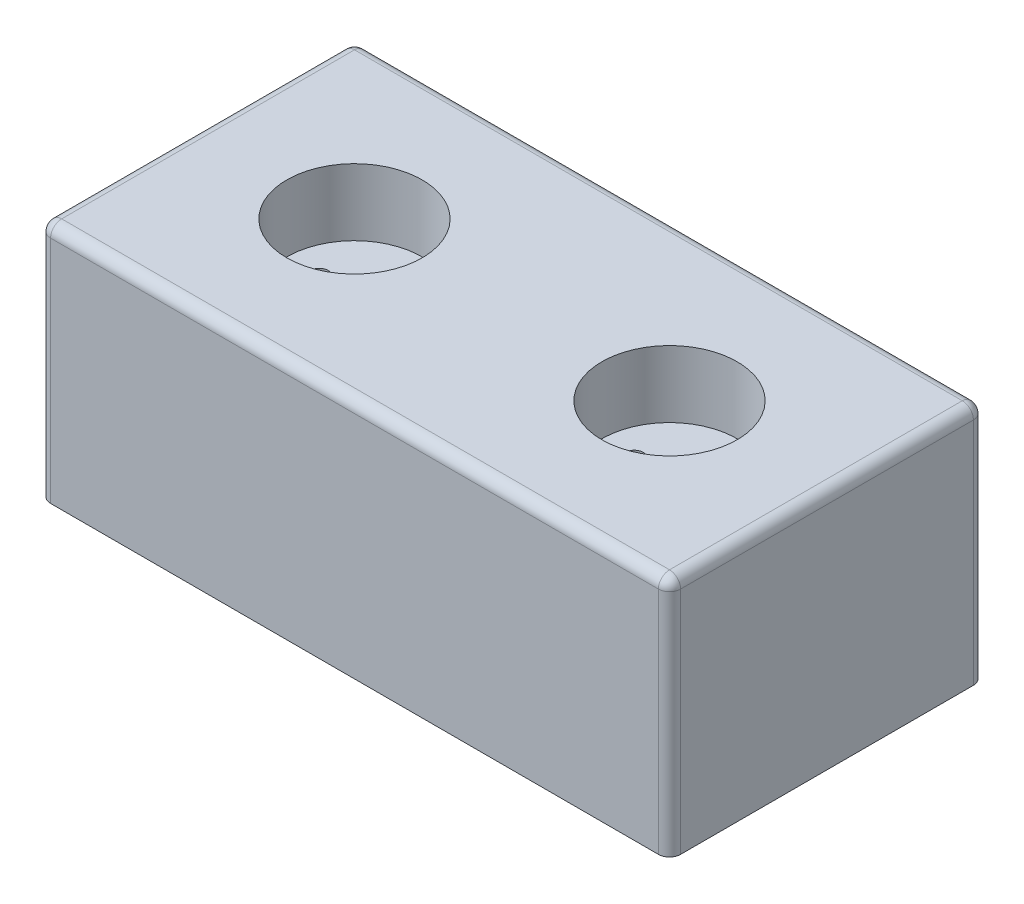
ISO-10303-21;
HEADER;
FILE_DESCRIPTION(('STEP AP214'),'2;1');
FILE_NAME('part.step','',(''),(''),'','','');
FILE_SCHEMA(('AUTOMOTIVE_DESIGN { 1 0 10303 214 1 1 1 1 }'));
ENDSEC;
DATA;
#1=APPLICATION_CONTEXT('core data for automotive mechanical design processes');
#2=APPLICATION_PROTOCOL_DEFINITION('international standard','automotive_design',2000,#1);
#3=PRODUCT_CONTEXT('',#1,'mechanical');
#4=PRODUCT('Part','Part','',(#3));
#5=PRODUCT_RELATED_PRODUCT_CATEGORY('part','',(#4));
#6=PRODUCT_DEFINITION_FORMATION('','',#4);
#7=PRODUCT_DEFINITION_CONTEXT('part definition',#1,'design');
#8=PRODUCT_DEFINITION('design','',#6,#7);
#9=PRODUCT_DEFINITION_SHAPE('','',#8);
#10=(LENGTH_UNIT() NAMED_UNIT(*) SI_UNIT(.MILLI.,.METRE.));
#11=(NAMED_UNIT(*) PLANE_ANGLE_UNIT() SI_UNIT($,.RADIAN.));
#12=(NAMED_UNIT(*) SI_UNIT($,.STERADIAN.) SOLID_ANGLE_UNIT());
#13=UNCERTAINTY_MEASURE_WITH_UNIT(LENGTH_MEASURE(1.E-05),#10,'distance_accuracy_value','');
#14=(GEOMETRIC_REPRESENTATION_CONTEXT(3) GLOBAL_UNCERTAINTY_ASSIGNED_CONTEXT((#13)) GLOBAL_UNIT_ASSIGNED_CONTEXT((#10,
#11,#12)) REPRESENTATION_CONTEXT('',''));
#15=CARTESIAN_POINT('',(0.,0.,0.));
#16=DIRECTION('',(0.,0.,1.));
#17=DIRECTION('',(1.,0.,0.));
#18=AXIS2_PLACEMENT_3D('',#15,#16,#17);
#19=CARTESIAN_POINT('',(-85.,65.,42.5));
#20=DIRECTION('',(1.,0.,0.));
#21=DIRECTION('',(0.,0.,-1.));
#22=AXIS2_PLACEMENT_3D('',#19,#20,#21);
#23=PLANE('',#22);
#24=DIRECTION('',(0.,0.,1.));
#25=VECTOR('',#24,1.);
#26=CARTESIAN_POINT('',(-85.,62.,-42.5));
#27=LINE('',#26,#25);
#28=CARTESIAN_POINT('',(-85.,62.,39.5));
#29=VERTEX_POINT('',#28);
#30=CARTESIAN_POINT('',(-85.,62.,-39.5));
#31=VERTEX_POINT('',#30);
#32=EDGE_CURVE('E157',#29,#31,#27,.F.);
#33=ORIENTED_EDGE('',*,*,#32,.T.);
#34=DIRECTION('',(0.,-1.,0.));
#35=VECTOR('',#34,1.);
#36=CARTESIAN_POINT('',(-85.,65.,-39.5));
#37=LINE('',#36,#35);
#38=CARTESIAN_POINT('',(-85.,0.,-39.5));
#39=VERTEX_POINT('',#38);
#40=EDGE_CURVE('E161',#31,#39,#37,.T.);
#41=ORIENTED_EDGE('',*,*,#40,.T.);
#42=DIRECTION('',(0.,0.,1.));
#43=VECTOR('',#42,1.);
#44=CARTESIAN_POINT('',(-85.,0.,42.5));
#45=LINE('',#44,#43);
#46=CARTESIAN_POINT('',(-85.,0.,39.5));
#47=VERTEX_POINT('',#46);
#48=EDGE_CURVE('E223',#39,#47,#45,.T.);
#49=ORIENTED_EDGE('',*,*,#48,.T.);
#50=DIRECTION('',(0.,-1.,0.));
#51=VECTOR('',#50,1.);
#52=CARTESIAN_POINT('',(-85.,65.,39.5));
#53=LINE('',#52,#51);
#54=EDGE_CURVE('E159',#47,#29,#53,.F.);
#55=ORIENTED_EDGE('',*,*,#54,.T.);
#56=EDGE_LOOP('',(#33,#41,#49,#55));
#57=FACE_BOUND('',#56,.T.);
#58=ADVANCED_FACE('F35',(#57),#23,.F.);
#59=CARTESIAN_POINT('',(85.,65.,42.5));
#60=DIRECTION('',(0.,0.,-1.));
#61=DIRECTION('',(-1.,0.,0.));
#62=AXIS2_PLACEMENT_3D('',#59,#60,#61);
#63=PLANE('',#62);
#64=DIRECTION('',(1.,0.,0.));
#65=VECTOR('',#64,1.);
#66=CARTESIAN_POINT('',(85.,0.,42.5));
#67=LINE('',#66,#65);
#68=CARTESIAN_POINT('',(-82.,0.,42.5));
#69=VERTEX_POINT('',#68);
#70=CARTESIAN_POINT('',(82.,0.,42.5));
#71=VERTEX_POINT('',#70);
#72=EDGE_CURVE('E144',#69,#71,#67,.T.);
#73=ORIENTED_EDGE('',*,*,#72,.T.);
#74=DIRECTION('',(0.,-1.,0.));
#75=VECTOR('',#74,1.);
#76=CARTESIAN_POINT('',(82.,65.,42.5));
#77=LINE('',#76,#75);
#78=CARTESIAN_POINT('',(82.,62.,42.5));
#79=VERTEX_POINT('',#78);
#80=EDGE_CURVE('E167',#71,#79,#77,.F.);
#81=ORIENTED_EDGE('',*,*,#80,.T.);
#82=DIRECTION('',(1.,0.,0.));
#83=VECTOR('',#82,1.);
#84=CARTESIAN_POINT('',(-85.,62.,42.5));
#85=LINE('',#84,#83);
#86=CARTESIAN_POINT('',(-82.,62.,42.5));
#87=VERTEX_POINT('',#86);
#88=EDGE_CURVE('E163',#79,#87,#85,.F.);
#89=ORIENTED_EDGE('',*,*,#88,.T.);
#90=DIRECTION('',(0.,-1.,0.));
#91=VECTOR('',#90,1.);
#92=CARTESIAN_POINT('',(-82.,65.,42.5));
#93=LINE('',#92,#91);
#94=EDGE_CURVE('E165',#87,#69,#93,.T.);
#95=ORIENTED_EDGE('',*,*,#94,.T.);
#96=EDGE_LOOP('',(#73,#81,#89,#95));
#97=FACE_BOUND('',#96,.T.);
#98=ADVANCED_FACE('F239',(#97),#63,.F.);
#99=CARTESIAN_POINT('',(85.,65.,42.5));
#100=DIRECTION('',(-1.,0.,0.));
#101=DIRECTION('',(0.,0.,1.));
#102=AXIS2_PLACEMENT_3D('',#99,#100,#101);
#103=PLANE('',#102);
#104=DIRECTION('',(0.,0.,-1.));
#105=VECTOR('',#104,1.);
#106=CARTESIAN_POINT('',(85.,0.,42.5));
#107=LINE('',#106,#105);
#108=CARTESIAN_POINT('',(85.,0.,39.5));
#109=VERTEX_POINT('',#108);
#110=CARTESIAN_POINT('',(85.,0.,-39.5));
#111=VERTEX_POINT('',#110);
#112=EDGE_CURVE('E141',#109,#111,#107,.T.);
#113=ORIENTED_EDGE('',*,*,#112,.T.);
#114=DIRECTION('',(0.,-1.,0.));
#115=VECTOR('',#114,1.);
#116=CARTESIAN_POINT('',(85.,65.,-39.5));
#117=LINE('',#116,#115);
#118=CARTESIAN_POINT('',(85.,62.,-39.5));
#119=VERTEX_POINT('',#118);
#120=EDGE_CURVE('E120',#111,#119,#117,.F.);
#121=ORIENTED_EDGE('',*,*,#120,.T.);
#122=DIRECTION('',(0.,0.,-1.));
#123=VECTOR('',#122,1.);
#124=CARTESIAN_POINT('',(85.,62.,42.5));
#125=LINE('',#124,#123);
#126=CARTESIAN_POINT('',(85.,62.,39.5));
#127=VERTEX_POINT('',#126);
#128=EDGE_CURVE('E125',#119,#127,#125,.F.);
#129=ORIENTED_EDGE('',*,*,#128,.T.);
#130=DIRECTION('',(0.,-1.,0.));
#131=VECTOR('',#130,1.);
#132=CARTESIAN_POINT('',(85.,65.,39.5));
#133=LINE('',#132,#131);
#134=EDGE_CURVE('E154',#127,#109,#133,.T.);
#135=ORIENTED_EDGE('',*,*,#134,.T.);
#136=EDGE_LOOP('',(#113,#121,#129,#135));
#137=FACE_BOUND('',#136,.T.);
#138=ADVANCED_FACE('F274',(#137),#103,.F.);
#139=CARTESIAN_POINT('',(85.,65.,-42.5));
#140=DIRECTION('',(0.,0.,1.));
#141=DIRECTION('',(1.,0.,0.));
#142=AXIS2_PLACEMENT_3D('',#139,#140,#141);
#143=PLANE('',#142);
#144=DIRECTION('',(-1.,0.,0.));
#145=VECTOR('',#144,1.);
#146=CARTESIAN_POINT('',(85.,62.,-42.5));
#147=LINE('',#146,#145);
#148=CARTESIAN_POINT('',(-82.,62.,-42.5));
#149=VERTEX_POINT('',#148);
#150=CARTESIAN_POINT('',(82.,62.,-42.5));
#151=VERTEX_POINT('',#150);
#152=EDGE_CURVE('E134',#149,#151,#147,.F.);
#153=ORIENTED_EDGE('',*,*,#152,.T.);
#154=DIRECTION('',(0.,-1.,0.));
#155=VECTOR('',#154,1.);
#156=CARTESIAN_POINT('',(82.,65.,-42.5));
#157=LINE('',#156,#155);
#158=CARTESIAN_POINT('',(82.,0.,-42.5));
#159=VERTEX_POINT('',#158);
#160=EDGE_CURVE('E119',#151,#159,#157,.T.);
#161=ORIENTED_EDGE('',*,*,#160,.T.);
#162=DIRECTION('',(-1.,0.,0.));
#163=VECTOR('',#162,1.);
#164=CARTESIAN_POINT('',(85.,0.,-42.5));
#165=LINE('',#164,#163);
#166=CARTESIAN_POINT('',(-82.,0.,-42.5));
#167=VERTEX_POINT('',#166);
#168=EDGE_CURVE('E131',#159,#167,#165,.T.);
#169=ORIENTED_EDGE('',*,*,#168,.T.);
#170=DIRECTION('',(0.,-1.,0.));
#171=VECTOR('',#170,1.);
#172=CARTESIAN_POINT('',(-82.,65.,-42.5));
#173=LINE('',#172,#171);
#174=EDGE_CURVE('E136',#167,#149,#173,.F.);
#175=ORIENTED_EDGE('',*,*,#174,.T.);
#176=EDGE_LOOP('',(#153,#161,#169,#175));
#177=FACE_BOUND('',#176,.T.);
#178=ADVANCED_FACE('F130',(#177),#143,.F.);
#179=CARTESIAN_POINT('',(0.,65.,0.));
#180=DIRECTION('',(0.,1.,0.));
#181=DIRECTION('',(0.,0.,1.));
#182=AXIS2_PLACEMENT_3D('',#179,#180,#181);
#183=PLANE('',#182);
#184=DIRECTION('',(1.,0.,0.));
#185=VECTOR('',#184,1.);
#186=CARTESIAN_POINT('',(85.,65.,39.5));
#187=LINE('',#186,#185);
#188=CARTESIAN_POINT('',(-82.,65.,39.5));
#189=VERTEX_POINT('',#188);
#190=CARTESIAN_POINT('',(82.,65.,39.5));
#191=VERTEX_POINT('',#190);
#192=EDGE_CURVE('E169',#189,#191,#187,.T.);
#193=ORIENTED_EDGE('',*,*,#192,.T.);
#194=DIRECTION('',(0.,0.,-1.));
#195=VECTOR('',#194,1.);
#196=CARTESIAN_POINT('',(82.,65.,-42.5));
#197=LINE('',#196,#195);
#198=CARTESIAN_POINT('',(82.,65.,-39.5));
#199=VERTEX_POINT('',#198);
#200=EDGE_CURVE('E11',#191,#199,#197,.T.);
#201=ORIENTED_EDGE('',*,*,#200,.T.);
#202=DIRECTION('',(-1.,0.,0.));
#203=VECTOR('',#202,1.);
#204=CARTESIAN_POINT('',(-85.,65.,-39.5));
#205=LINE('',#204,#203);
#206=CARTESIAN_POINT('',(-82.,65.,-39.5));
#207=VERTEX_POINT('',#206);
#208=EDGE_CURVE('E44',#199,#207,#205,.T.);
#209=ORIENTED_EDGE('',*,*,#208,.T.);
#210=DIRECTION('',(0.,0.,1.));
#211=VECTOR('',#210,1.);
#212=CARTESIAN_POINT('',(-82.,65.,42.5));
#213=LINE('',#212,#211);
#214=EDGE_CURVE('E171',#207,#189,#213,.T.);
#215=ORIENTED_EDGE('',*,*,#214,.T.);
#216=EDGE_LOOP('',(#193,#201,#209,#215));
#217=FACE_BOUND('',#216,.T.);
#218=CARTESIAN_POINT('',(-42.5,65.,0.));
#219=DIRECTION('',(0.,1.,0.));
#220=DIRECTION('',(0.,0.,1.));
#221=AXIS2_PLACEMENT_3D('',#218,#219,#220);
#222=CIRCLE('',#221,18.25);
#223=CARTESIAN_POINT('',(-42.5,65.,18.25));
#224=VERTEX_POINT('',#223);
#225=EDGE_CURVE('E224',#224,#224,#222,.T.);
#226=ORIENTED_EDGE('',*,*,#225,.F.);
#227=EDGE_LOOP('',(#226));
#228=FACE_BOUND('',#227,.T.);
#229=CARTESIAN_POINT('',(42.5,65.,0.));
#230=DIRECTION('',(0.,1.,0.));
#231=DIRECTION('',(0.,0.,1.));
#232=AXIS2_PLACEMENT_3D('',#229,#230,#231);
#233=CIRCLE('',#232,18.25);
#234=CARTESIAN_POINT('',(42.5,65.,18.25));
#235=VERTEX_POINT('',#234);
#236=EDGE_CURVE('E230',#235,#235,#233,.T.);
#237=ORIENTED_EDGE('',*,*,#236,.F.);
#238=EDGE_LOOP('',(#237));
#239=FACE_BOUND('',#238,.T.);
#240=ADVANCED_FACE('F281',(#217,#228,#239),#183,.T.);
#241=CARTESIAN_POINT('',(0.,0.,0.));
#242=DIRECTION('',(0.,1.,0.));
#243=DIRECTION('',(0.,0.,1.));
#244=AXIS2_PLACEMENT_3D('',#241,#242,#243);
#245=PLANE('',#244);
#246=ORIENTED_EDGE('',*,*,#168,.F.);
#247=CARTESIAN_POINT('',(82.,0.,-39.5));
#248=DIRECTION('',(0.,1.,0.));
#249=DIRECTION('',(0.,0.,1.));
#250=AXIS2_PLACEMENT_3D('',#247,#248,#249);
#251=CIRCLE('',#250,3.);
#252=EDGE_CURVE('E115',#159,#111,#251,.F.);
#253=ORIENTED_EDGE('',*,*,#252,.T.);
#254=ORIENTED_EDGE('',*,*,#112,.F.);
#255=CARTESIAN_POINT('',(82.,0.,39.5));
#256=DIRECTION('',(0.,1.,0.));
#257=DIRECTION('',(0.,0.,1.));
#258=AXIS2_PLACEMENT_3D('',#255,#256,#257);
#259=CIRCLE('',#258,3.);
#260=EDGE_CURVE('E150',#109,#71,#259,.F.);
#261=ORIENTED_EDGE('',*,*,#260,.T.);
#262=ORIENTED_EDGE('',*,*,#72,.F.);
#263=CARTESIAN_POINT('',(-82.,0.,39.5));
#264=DIRECTION('',(0.,1.,0.));
#265=DIRECTION('',(0.,0.,1.));
#266=AXIS2_PLACEMENT_3D('',#263,#264,#265);
#267=CIRCLE('',#266,3.);
#268=EDGE_CURVE('E135',#69,#47,#267,.F.);
#269=ORIENTED_EDGE('',*,*,#268,.T.);
#270=ORIENTED_EDGE('',*,*,#48,.F.);
#271=CARTESIAN_POINT('',(-82.,0.,-39.5));
#272=DIRECTION('',(0.,1.,0.));
#273=DIRECTION('',(0.,0.,1.));
#274=AXIS2_PLACEMENT_3D('',#271,#272,#273);
#275=CIRCLE('',#274,3.);
#276=EDGE_CURVE('E126',#39,#167,#275,.F.);
#277=ORIENTED_EDGE('',*,*,#276,.T.);
#278=EDGE_LOOP('',(#246,#253,#254,#261,#262,#269,#270,#277));
#279=FACE_BOUND('',#278,.T.);
#280=ADVANCED_FACE('F138',(#279),#245,.F.);
#281=CARTESIAN_POINT('',(42.5,47.,0.));
#282=DIRECTION('',(0.,1.,0.));
#283=DIRECTION('',(0.,0.,1.));
#284=AXIS2_PLACEMENT_3D('',#281,#282,#283);
#285=CYLINDRICAL_SURFACE('',#284,18.25);
#286=CARTESIAN_POINT('',(42.5,47.,0.));
#287=DIRECTION('',(0.,1.,0.));
#288=DIRECTION('',(0.,0.,1.));
#289=AXIS2_PLACEMENT_3D('',#286,#287,#288);
#290=CIRCLE('',#289,18.25);
#291=CARTESIAN_POINT('',(42.5,47.,18.25));
#292=VERTEX_POINT('',#291);
#293=EDGE_CURVE('E227',#292,#292,#290,.T.);
#294=ORIENTED_EDGE('',*,*,#293,.F.);
#295=EDGE_LOOP('',(#294));
#296=FACE_BOUND('',#295,.T.);
#297=ORIENTED_EDGE('',*,*,#236,.T.);
#298=EDGE_LOOP('',(#297));
#299=FACE_BOUND('',#298,.T.);
#300=ADVANCED_FACE('F350',(#296,#299),#285,.F.);
#301=CARTESIAN_POINT('',(42.5,47.,0.));
#302=DIRECTION('',(0.,1.,0.));
#303=DIRECTION('',(0.,0.,1.));
#304=AXIS2_PLACEMENT_3D('',#301,#302,#303);
#305=PLANE('',#304);
#306=CARTESIAN_POINT('',(33.,47.,0.));
#307=DIRECTION('',(0.,1.,0.));
#308=DIRECTION('',(0.,0.,1.));
#309=AXIS2_PLACEMENT_3D('',#306,#307,#308);
#310=CIRCLE('',#309,2.4);
#311=CARTESIAN_POINT('',(33.,47.,2.4));
#312=VERTEX_POINT('',#311);
#313=EDGE_CURVE('E216',#312,#312,#310,.T.);
#314=ORIENTED_EDGE('',*,*,#313,.F.);
#315=EDGE_LOOP('',(#314));
#316=FACE_BOUND('',#315,.T.);
#317=CARTESIAN_POINT('',(52.,47.,0.));
#318=DIRECTION('',(0.,1.,0.));
#319=DIRECTION('',(0.,0.,1.));
#320=AXIS2_PLACEMENT_3D('',#317,#318,#319);
#321=CIRCLE('',#320,2.4);
#322=CARTESIAN_POINT('',(52.,47.,2.4));
#323=VERTEX_POINT('',#322);
#324=EDGE_CURVE('E206',#323,#323,#321,.T.);
#325=ORIENTED_EDGE('',*,*,#324,.F.);
#326=EDGE_LOOP('',(#325));
#327=FACE_BOUND('',#326,.T.);
#328=ORIENTED_EDGE('',*,*,#293,.T.);
#329=EDGE_LOOP('',(#328));
#330=FACE_BOUND('',#329,.T.);
#331=ADVANCED_FACE('F346',(#316,#327,#330),#305,.T.);
#332=CARTESIAN_POINT('',(-42.5,47.,0.));
#333=DIRECTION('',(0.,1.,0.));
#334=DIRECTION('',(0.,0.,1.));
#335=AXIS2_PLACEMENT_3D('',#332,#333,#334);
#336=CYLINDRICAL_SURFACE('',#335,18.25);
#337=CARTESIAN_POINT('',(-42.5,47.,0.));
#338=DIRECTION('',(0.,1.,0.));
#339=DIRECTION('',(0.,0.,1.));
#340=AXIS2_PLACEMENT_3D('',#337,#338,#339);
#341=CIRCLE('',#340,18.25);
#342=CARTESIAN_POINT('',(-42.5,47.,18.25));
#343=VERTEX_POINT('',#342);
#344=EDGE_CURVE('E220',#343,#343,#341,.T.);
#345=ORIENTED_EDGE('',*,*,#344,.F.);
#346=EDGE_LOOP('',(#345));
#347=FACE_BOUND('',#346,.T.);
#348=ORIENTED_EDGE('',*,*,#225,.T.);
#349=EDGE_LOOP('',(#348));
#350=FACE_BOUND('',#349,.T.);
#351=ADVANCED_FACE('F342',(#347,#350),#336,.F.);
#352=CARTESIAN_POINT('',(-42.5,47.,0.));
#353=DIRECTION('',(0.,1.,0.));
#354=DIRECTION('',(0.,0.,1.));
#355=AXIS2_PLACEMENT_3D('',#352,#353,#354);
#356=PLANE('',#355);
#357=CARTESIAN_POINT('',(-52.,47.,0.));
#358=DIRECTION('',(0.,1.,0.));
#359=DIRECTION('',(0.,0.,1.));
#360=AXIS2_PLACEMENT_3D('',#357,#358,#359);
#361=CIRCLE('',#360,2.4);
#362=CARTESIAN_POINT('',(-52.,47.,2.4));
#363=VERTEX_POINT('',#362);
#364=EDGE_CURVE('E542',#363,#363,#361,.T.);
#365=ORIENTED_EDGE('',*,*,#364,.F.);
#366=EDGE_LOOP('',(#365));
#367=FACE_BOUND('',#366,.T.);
#368=CARTESIAN_POINT('',(-33.,47.,0.));
#369=DIRECTION('',(0.,1.,0.));
#370=DIRECTION('',(0.,0.,1.));
#371=AXIS2_PLACEMENT_3D('',#368,#369,#370);
#372=CIRCLE('',#371,2.4);
#373=CARTESIAN_POINT('',(-33.,47.,2.4));
#374=VERTEX_POINT('',#373);
#375=EDGE_CURVE('E550',#374,#374,#372,.T.);
#376=ORIENTED_EDGE('',*,*,#375,.F.);
#377=EDGE_LOOP('',(#376));
#378=FACE_BOUND('',#377,.T.);
#379=ORIENTED_EDGE('',*,*,#344,.T.);
#380=EDGE_LOOP('',(#379));
#381=FACE_BOUND('',#380,.T.);
#382=ADVANCED_FACE('F339',(#367,#378,#381),#356,.T.);
#383=CARTESIAN_POINT('',(-33.,32.,0.));
#384=DIRECTION('',(0.,1.,0.));
#385=DIRECTION('',(0.,0.,1.));
#386=AXIS2_PLACEMENT_3D('',#383,#384,#385);
#387=CYLINDRICAL_SURFACE('',#386,2.4);
#388=CARTESIAN_POINT('',(-33.,32.,0.));
#389=DIRECTION('',(0.,1.,0.));
#390=DIRECTION('',(0.,0.,1.));
#391=AXIS2_PLACEMENT_3D('',#388,#389,#390);
#392=CIRCLE('',#391,2.4);
#393=CARTESIAN_POINT('',(-33.,32.,2.4));
#394=VERTEX_POINT('',#393);
#395=EDGE_CURVE('E545',#394,#394,#392,.T.);
#396=ORIENTED_EDGE('',*,*,#395,.F.);
#397=EDGE_LOOP('',(#396));
#398=FACE_BOUND('',#397,.T.);
#399=ORIENTED_EDGE('',*,*,#375,.T.);
#400=EDGE_LOOP('',(#399));
#401=FACE_BOUND('',#400,.T.);
#402=ADVANCED_FACE('F328',(#398,#401),#387,.F.);
#403=CARTESIAN_POINT('',(-33.,32.,0.));
#404=DIRECTION('',(0.,1.,0.));
#405=DIRECTION('',(0.,0.,1.));
#406=AXIS2_PLACEMENT_3D('',#403,#404,#405);
#407=PLANE('',#406);
#408=ORIENTED_EDGE('',*,*,#395,.T.);
#409=EDGE_LOOP('',(#408));
#410=FACE_BOUND('',#409,.T.);
#411=ADVANCED_FACE('F384',(#410),#407,.T.);
#412=CARTESIAN_POINT('',(-52.,32.,0.));
#413=DIRECTION('',(0.,1.,0.));
#414=DIRECTION('',(0.,0.,1.));
#415=AXIS2_PLACEMENT_3D('',#412,#413,#414);
#416=CYLINDRICAL_SURFACE('',#415,2.4);
#417=CARTESIAN_POINT('',(-52.,32.,0.));
#418=DIRECTION('',(0.,1.,0.));
#419=DIRECTION('',(0.,0.,1.));
#420=AXIS2_PLACEMENT_3D('',#417,#418,#419);
#421=CIRCLE('',#420,2.4);
#422=CARTESIAN_POINT('',(-52.,32.,2.4));
#423=VERTEX_POINT('',#422);
#424=EDGE_CURVE('E233',#423,#423,#421,.T.);
#425=ORIENTED_EDGE('',*,*,#424,.F.);
#426=EDGE_LOOP('',(#425));
#427=FACE_BOUND('',#426,.T.);
#428=ORIENTED_EDGE('',*,*,#364,.T.);
#429=EDGE_LOOP('',(#428));
#430=FACE_BOUND('',#429,.T.);
#431=ADVANCED_FACE('F391',(#427,#430),#416,.F.);
#432=CARTESIAN_POINT('',(-52.,32.,0.));
#433=DIRECTION('',(0.,1.,0.));
#434=DIRECTION('',(0.,0.,1.));
#435=AXIS2_PLACEMENT_3D('',#432,#433,#434);
#436=PLANE('',#435);
#437=ORIENTED_EDGE('',*,*,#424,.T.);
#438=EDGE_LOOP('',(#437));
#439=FACE_BOUND('',#438,.T.);
#440=ADVANCED_FACE('F337',(#439),#436,.T.);
#441=CARTESIAN_POINT('',(52.,32.,0.));
#442=DIRECTION('',(0.,1.,0.));
#443=DIRECTION('',(0.,0.,1.));
#444=AXIS2_PLACEMENT_3D('',#441,#442,#443);
#445=CYLINDRICAL_SURFACE('',#444,2.4);
#446=CARTESIAN_POINT('',(52.,32.,0.));
#447=DIRECTION('',(0.,1.,0.));
#448=DIRECTION('',(0.,0.,1.));
#449=AXIS2_PLACEMENT_3D('',#446,#447,#448);
#450=CIRCLE('',#449,2.4);
#451=CARTESIAN_POINT('',(52.,32.,2.4));
#452=VERTEX_POINT('',#451);
#453=EDGE_CURVE('E211',#452,#452,#450,.T.);
#454=ORIENTED_EDGE('',*,*,#453,.F.);
#455=EDGE_LOOP('',(#454));
#456=FACE_BOUND('',#455,.T.);
#457=ORIENTED_EDGE('',*,*,#324,.T.);
#458=EDGE_LOOP('',(#457));
#459=FACE_BOUND('',#458,.T.);
#460=ADVANCED_FACE('F333',(#456,#459),#445,.F.);
#461=CARTESIAN_POINT('',(52.,32.,0.));
#462=DIRECTION('',(0.,1.,0.));
#463=DIRECTION('',(0.,0.,1.));
#464=AXIS2_PLACEMENT_3D('',#461,#462,#463);
#465=PLANE('',#464);
#466=ORIENTED_EDGE('',*,*,#453,.T.);
#467=EDGE_LOOP('',(#466));
#468=FACE_BOUND('',#467,.T.);
#469=ADVANCED_FACE('F323',(#468),#465,.T.);
#470=CARTESIAN_POINT('',(33.,32.,0.));
#471=DIRECTION('',(0.,1.,0.));
#472=DIRECTION('',(0.,0.,1.));
#473=AXIS2_PLACEMENT_3D('',#470,#471,#472);
#474=CYLINDRICAL_SURFACE('',#473,2.4);
#475=CARTESIAN_POINT('',(33.,32.,0.));
#476=DIRECTION('',(0.,1.,0.));
#477=DIRECTION('',(0.,0.,1.));
#478=AXIS2_PLACEMENT_3D('',#475,#476,#477);
#479=CIRCLE('',#478,2.4);
#480=CARTESIAN_POINT('',(33.,32.,2.4));
#481=VERTEX_POINT('',#480);
#482=EDGE_CURVE('E553',#481,#481,#479,.T.);
#483=ORIENTED_EDGE('',*,*,#482,.F.);
#484=EDGE_LOOP('',(#483));
#485=FACE_BOUND('',#484,.T.);
#486=ORIENTED_EDGE('',*,*,#313,.T.);
#487=EDGE_LOOP('',(#486));
#488=FACE_BOUND('',#487,.T.);
#489=ADVANCED_FACE('F317',(#485,#488),#474,.F.);
#490=CARTESIAN_POINT('',(33.,32.,0.));
#491=DIRECTION('',(0.,1.,0.));
#492=DIRECTION('',(0.,0.,1.));
#493=AXIS2_PLACEMENT_3D('',#490,#491,#492);
#494=PLANE('',#493);
#495=ORIENTED_EDGE('',*,*,#482,.T.);
#496=EDGE_LOOP('',(#495));
#497=FACE_BOUND('',#496,.T.);
#498=ADVANCED_FACE('F313',(#497),#494,.T.);
#499=CARTESIAN_POINT('',(-82.,65.,39.5));
#500=DIRECTION('',(0.,-1.,0.));
#501=DIRECTION('',(0.,0.,-1.));
#502=AXIS2_PLACEMENT_3D('',#499,#500,#501);
#503=CYLINDRICAL_SURFACE('',#502,3.);
#504=CARTESIAN_POINT('',(-82.,62.,39.5));
#505=DIRECTION('',(0.,1.,0.));
#506=DIRECTION('',(0.,0.,1.));
#507=AXIS2_PLACEMENT_3D('',#504,#505,#506);
#508=CIRCLE('',#507,3.);
#509=EDGE_CURVE('E39',#29,#87,#508,.T.);
#510=ORIENTED_EDGE('',*,*,#509,.F.);
#511=ORIENTED_EDGE('',*,*,#54,.F.);
#512=ORIENTED_EDGE('',*,*,#268,.F.);
#513=ORIENTED_EDGE('',*,*,#94,.F.);
#514=EDGE_LOOP('',(#510,#511,#512,#513));
#515=FACE_BOUND('',#514,.T.);
#516=ADVANCED_FACE('F37',(#515),#503,.T.);
#517=CARTESIAN_POINT('',(-82.,62.,39.5));
#518=DIRECTION('',(0.,0.,1.));
#519=DIRECTION('',(1.,0.,0.));
#520=AXIS2_PLACEMENT_3D('',#517,#518,#519);
#521=SPHERICAL_SURFACE('',#520,3.);
#522=CARTESIAN_POINT('',(-82.,62.,39.5));
#523=DIRECTION('',(0.,0.,1.));
#524=DIRECTION('',(1.,0.,0.));
#525=AXIS2_PLACEMENT_3D('',#522,#523,#524);
#526=CIRCLE('',#525,3.);
#527=EDGE_CURVE('E197',#29,#189,#526,.F.);
#528=ORIENTED_EDGE('',*,*,#527,.F.);
#529=ORIENTED_EDGE('',*,*,#509,.T.);
#530=CARTESIAN_POINT('',(-82.,62.,39.5));
#531=DIRECTION('',(-1.,0.,0.));
#532=DIRECTION('',(0.,0.,1.));
#533=AXIS2_PLACEMENT_3D('',#530,#531,#532);
#534=CIRCLE('',#533,3.);
#535=EDGE_CURVE('E199',#189,#87,#534,.F.);
#536=ORIENTED_EDGE('',*,*,#535,.F.);
#537=EDGE_LOOP('',(#528,#529,#536));
#538=FACE_BOUND('',#537,.T.);
#539=ADVANCED_FACE('F308',(#538),#521,.T.);
#540=CARTESIAN_POINT('',(82.,65.,39.5));
#541=DIRECTION('',(0.,-1.,0.));
#542=DIRECTION('',(0.,0.,-1.));
#543=AXIS2_PLACEMENT_3D('',#540,#541,#542);
#544=CYLINDRICAL_SURFACE('',#543,3.);
#545=ORIENTED_EDGE('',*,*,#260,.F.);
#546=ORIENTED_EDGE('',*,*,#134,.F.);
#547=CARTESIAN_POINT('',(82.,62.,39.5));
#548=DIRECTION('',(0.,1.,0.));
#549=DIRECTION('',(0.,0.,1.));
#550=AXIS2_PLACEMENT_3D('',#547,#548,#549);
#551=CIRCLE('',#550,3.);
#552=EDGE_CURVE('E194',#79,#127,#551,.T.);
#553=ORIENTED_EDGE('',*,*,#552,.F.);
#554=ORIENTED_EDGE('',*,*,#80,.F.);
#555=EDGE_LOOP('',(#545,#546,#553,#554));
#556=FACE_BOUND('',#555,.T.);
#557=ADVANCED_FACE('F245',(#556),#544,.T.);
#558=CARTESIAN_POINT('',(0.,62.,39.5));
#559=DIRECTION('',(-1.,0.,0.));
#560=DIRECTION('',(0.,0.,1.));
#561=AXIS2_PLACEMENT_3D('',#558,#559,#560);
#562=CYLINDRICAL_SURFACE('',#561,3.);
#563=ORIENTED_EDGE('',*,*,#535,.T.);
#564=ORIENTED_EDGE('',*,*,#88,.F.);
#565=CARTESIAN_POINT('',(82.,62.,39.5));
#566=DIRECTION('',(1.,0.,0.));
#567=DIRECTION('',(0.,0.,-1.));
#568=AXIS2_PLACEMENT_3D('',#565,#566,#567);
#569=CIRCLE('',#568,3.);
#570=EDGE_CURVE('E191',#191,#79,#569,.T.);
#571=ORIENTED_EDGE('',*,*,#570,.F.);
#572=ORIENTED_EDGE('',*,*,#192,.F.);
#573=EDGE_LOOP('',(#563,#564,#571,#572));
#574=FACE_BOUND('',#573,.T.);
#575=ADVANCED_FACE('F252',(#574),#562,.T.);
#576=CARTESIAN_POINT('',(-82.,62.,0.));
#577=DIRECTION('',(0.,0.,-1.));
#578=DIRECTION('',(-1.,0.,0.));
#579=AXIS2_PLACEMENT_3D('',#576,#577,#578);
#580=CYLINDRICAL_SURFACE('',#579,3.);
#581=ORIENTED_EDGE('',*,*,#527,.T.);
#582=ORIENTED_EDGE('',*,*,#214,.F.);
#583=CARTESIAN_POINT('',(-82.,62.,-39.5));
#584=DIRECTION('',(0.,0.,-1.));
#585=DIRECTION('',(-1.,0.,0.));
#586=AXIS2_PLACEMENT_3D('',#583,#584,#585);
#587=CIRCLE('',#586,3.);
#588=EDGE_CURVE('E188',#31,#207,#587,.T.);
#589=ORIENTED_EDGE('',*,*,#588,.F.);
#590=ORIENTED_EDGE('',*,*,#32,.F.);
#591=EDGE_LOOP('',(#581,#582,#589,#590));
#592=FACE_BOUND('',#591,.T.);
#593=ADVANCED_FACE('F264',(#592),#580,.T.);
#594=CARTESIAN_POINT('',(-82.,65.,-39.5));
#595=DIRECTION('',(0.,-1.,0.));
#596=DIRECTION('',(0.,0.,-1.));
#597=AXIS2_PLACEMENT_3D('',#594,#595,#596);
#598=CYLINDRICAL_SURFACE('',#597,3.);
#599=ORIENTED_EDGE('',*,*,#276,.F.);
#600=ORIENTED_EDGE('',*,*,#40,.F.);
#601=CARTESIAN_POINT('',(-82.,62.,-39.5));
#602=DIRECTION('',(0.,1.,0.));
#603=DIRECTION('',(0.,0.,1.));
#604=AXIS2_PLACEMENT_3D('',#601,#602,#603);
#605=CIRCLE('',#604,3.);
#606=EDGE_CURVE('E185',#149,#31,#605,.T.);
#607=ORIENTED_EDGE('',*,*,#606,.F.);
#608=ORIENTED_EDGE('',*,*,#174,.F.);
#609=EDGE_LOOP('',(#599,#600,#607,#608));
#610=FACE_BOUND('',#609,.T.);
#611=ADVANCED_FACE('F261',(#610),#598,.T.);
#612=CARTESIAN_POINT('',(82.,62.,39.5));
#613=DIRECTION('',(0.,0.,1.));
#614=DIRECTION('',(1.,0.,0.));
#615=AXIS2_PLACEMENT_3D('',#612,#613,#614);
#616=SPHERICAL_SURFACE('',#615,3.);
#617=ORIENTED_EDGE('',*,*,#570,.T.);
#618=ORIENTED_EDGE('',*,*,#552,.T.);
#619=CARTESIAN_POINT('',(82.,62.,39.5));
#620=DIRECTION('',(0.,0.,1.));
#621=DIRECTION('',(1.,0.,0.));
#622=AXIS2_PLACEMENT_3D('',#619,#620,#621);
#623=CIRCLE('',#622,3.);
#624=EDGE_CURVE('E182',#191,#127,#623,.F.);
#625=ORIENTED_EDGE('',*,*,#624,.F.);
#626=EDGE_LOOP('',(#617,#618,#625));
#627=FACE_BOUND('',#626,.T.);
#628=ADVANCED_FACE('F250',(#627),#616,.T.);
#629=CARTESIAN_POINT('',(-82.,62.,-39.5));
#630=DIRECTION('',(0.,0.,1.));
#631=DIRECTION('',(1.,0.,0.));
#632=AXIS2_PLACEMENT_3D('',#629,#630,#631);
#633=SPHERICAL_SURFACE('',#632,3.);
#634=ORIENTED_EDGE('',*,*,#606,.T.);
#635=ORIENTED_EDGE('',*,*,#588,.T.);
#636=CARTESIAN_POINT('',(-82.,62.,-39.5));
#637=DIRECTION('',(-1.,0.,0.));
#638=DIRECTION('',(0.,0.,1.));
#639=AXIS2_PLACEMENT_3D('',#636,#637,#638);
#640=CIRCLE('',#639,3.);
#641=EDGE_CURVE('E179',#149,#207,#640,.F.);
#642=ORIENTED_EDGE('',*,*,#641,.F.);
#643=EDGE_LOOP('',(#634,#635,#642));
#644=FACE_BOUND('',#643,.T.);
#645=ADVANCED_FACE('F266',(#644),#633,.T.);
#646=CARTESIAN_POINT('',(82.,62.,0.));
#647=DIRECTION('',(0.,0.,1.));
#648=DIRECTION('',(1.,0.,0.));
#649=AXIS2_PLACEMENT_3D('',#646,#647,#648);
#650=CYLINDRICAL_SURFACE('',#649,3.);
#651=ORIENTED_EDGE('',*,*,#624,.T.);
#652=ORIENTED_EDGE('',*,*,#128,.F.);
#653=CARTESIAN_POINT('',(82.,62.,-39.5));
#654=DIRECTION('',(0.,0.,-1.));
#655=DIRECTION('',(-1.,0.,0.));
#656=AXIS2_PLACEMENT_3D('',#653,#654,#655);
#657=CIRCLE('',#656,3.);
#658=EDGE_CURVE('E177',#199,#119,#657,.T.);
#659=ORIENTED_EDGE('',*,*,#658,.F.);
#660=ORIENTED_EDGE('',*,*,#200,.F.);
#661=EDGE_LOOP('',(#651,#652,#659,#660));
#662=FACE_BOUND('',#661,.T.);
#663=ADVANCED_FACE('F272',(#662),#650,.T.);
#664=CARTESIAN_POINT('',(0.,62.,-39.5));
#665=DIRECTION('',(1.,0.,0.));
#666=DIRECTION('',(0.,0.,-1.));
#667=AXIS2_PLACEMENT_3D('',#664,#665,#666);
#668=CYLINDRICAL_SURFACE('',#667,3.);
#669=ORIENTED_EDGE('',*,*,#641,.T.);
#670=ORIENTED_EDGE('',*,*,#208,.F.);
#671=CARTESIAN_POINT('',(82.,62.,-39.5));
#672=DIRECTION('',(1.,0.,0.));
#673=DIRECTION('',(0.,0.,-1.));
#674=AXIS2_PLACEMENT_3D('',#671,#672,#673);
#675=CIRCLE('',#674,3.);
#676=EDGE_CURVE('E52',#151,#199,#675,.T.);
#677=ORIENTED_EDGE('',*,*,#676,.F.);
#678=ORIENTED_EDGE('',*,*,#152,.F.);
#679=EDGE_LOOP('',(#669,#670,#677,#678));
#680=FACE_BOUND('',#679,.T.);
#681=ADVANCED_FACE('F268',(#680),#668,.T.);
#682=CARTESIAN_POINT('',(82.,62.,-39.5));
#683=DIRECTION('',(0.,0.,1.));
#684=DIRECTION('',(1.,0.,0.));
#685=AXIS2_PLACEMENT_3D('',#682,#683,#684);
#686=SPHERICAL_SURFACE('',#685,3.);
#687=ORIENTED_EDGE('',*,*,#676,.T.);
#688=ORIENTED_EDGE('',*,*,#658,.T.);
#689=CARTESIAN_POINT('',(82.,62.,-39.5));
#690=DIRECTION('',(0.,1.,0.));
#691=DIRECTION('',(0.,0.,1.));
#692=AXIS2_PLACEMENT_3D('',#689,#690,#691);
#693=CIRCLE('',#692,3.);
#694=EDGE_CURVE('E174',#151,#119,#693,.F.);
#695=ORIENTED_EDGE('',*,*,#694,.F.);
#696=EDGE_LOOP('',(#687,#688,#695));
#697=FACE_BOUND('',#696,.T.);
#698=ADVANCED_FACE('F269',(#697),#686,.T.);
#699=CARTESIAN_POINT('',(82.,65.,-39.5));
#700=DIRECTION('',(0.,-1.,0.));
#701=DIRECTION('',(0.,0.,-1.));
#702=AXIS2_PLACEMENT_3D('',#699,#700,#701);
#703=CYLINDRICAL_SURFACE('',#702,3.);
#704=ORIENTED_EDGE('',*,*,#694,.T.);
#705=ORIENTED_EDGE('',*,*,#120,.F.);
#706=ORIENTED_EDGE('',*,*,#252,.F.);
#707=ORIENTED_EDGE('',*,*,#160,.F.);
#708=EDGE_LOOP('',(#704,#705,#706,#707));
#709=FACE_BOUND('',#708,.T.);
#710=ADVANCED_FACE('F118',(#709),#703,.T.);
#711=CLOSED_SHELL('',(#58,#98,#138,#178,#240,#280,#300,#331,#351,#382,#402,#411,#431,#440,#460,
#469,#489,#498,#516,#539,#557,#575,#593,#611,#628,#645,#663,#681,#698,#710));
#712=MANIFOLD_SOLID_BREP('B2',#711);
#713=ADVANCED_BREP_SHAPE_REPRESENTATION('',(#18,#712),#14);
#714=SHAPE_DEFINITION_REPRESENTATION(#9,#713);
ENDSEC;
END-ISO-10303-21;
